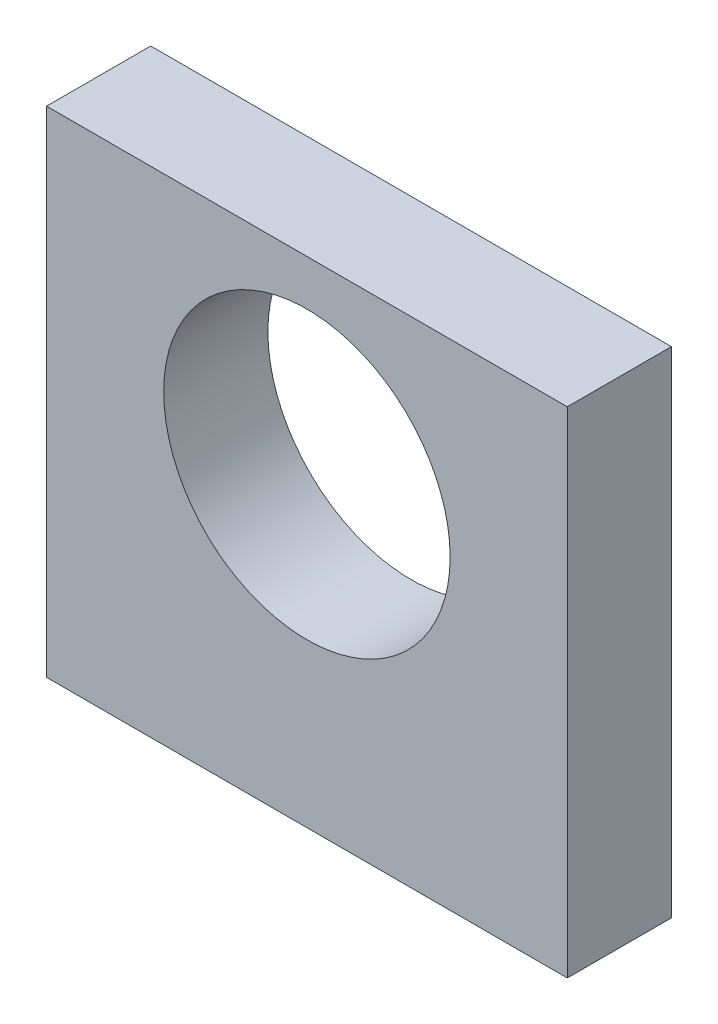
ISO-10303-21;
HEADER;
FILE_DESCRIPTION(('STEP AP214'),'2;1');
FILE_NAME('part.step','',(''),(''),'','','');
FILE_SCHEMA(('AUTOMOTIVE_DESIGN { 1 0 10303 214 1 1 1 1 }'));
ENDSEC;
DATA;
#1=APPLICATION_CONTEXT('core data for automotive mechanical design processes');
#2=APPLICATION_PROTOCOL_DEFINITION('international standard','automotive_design',2000,#1);
#3=PRODUCT_CONTEXT('',#1,'mechanical');
#4=PRODUCT('Part','Part','',(#3));
#5=PRODUCT_RELATED_PRODUCT_CATEGORY('part','',(#4));
#6=PRODUCT_DEFINITION_FORMATION('','',#4);
#7=PRODUCT_DEFINITION_CONTEXT('part definition',#1,'design');
#8=PRODUCT_DEFINITION('design','',#6,#7);
#9=PRODUCT_DEFINITION_SHAPE('','',#8);
#10=(LENGTH_UNIT() NAMED_UNIT(*) SI_UNIT(.MILLI.,.METRE.));
#11=(NAMED_UNIT(*) PLANE_ANGLE_UNIT() SI_UNIT($,.RADIAN.));
#12=(NAMED_UNIT(*) SI_UNIT($,.STERADIAN.) SOLID_ANGLE_UNIT());
#13=UNCERTAINTY_MEASURE_WITH_UNIT(LENGTH_MEASURE(1.E-05),#10,'distance_accuracy_value','');
#14=(GEOMETRIC_REPRESENTATION_CONTEXT(3) GLOBAL_UNCERTAINTY_ASSIGNED_CONTEXT((#13)) GLOBAL_UNIT_ASSIGNED_CONTEXT((#10,
#11,#12)) REPRESENTATION_CONTEXT('',''));
#15=CARTESIAN_POINT('',(0.,0.,0.));
#16=DIRECTION('',(0.,0.,1.));
#17=DIRECTION('',(1.,0.,0.));
#18=AXIS2_PLACEMENT_3D('',#15,#16,#17);
#19=CARTESIAN_POINT('',(-20.,-19.,8.));
#20=DIRECTION('',(1.,0.,0.));
#21=DIRECTION('',(0.,0.,-1.));
#22=AXIS2_PLACEMENT_3D('',#19,#20,#21);
#23=PLANE('',#22);
#24=DIRECTION('',(0.,-1.,0.));
#25=VECTOR('',#24,1.);
#26=CARTESIAN_POINT('',(-20.,-19.,0.));
#27=LINE('',#26,#25);
#28=CARTESIAN_POINT('',(-20.,19.,0.));
#29=VERTEX_POINT('',#28);
#30=CARTESIAN_POINT('',(-20.,-19.,0.));
#31=VERTEX_POINT('',#30);
#32=EDGE_CURVE('E126',#29,#31,#27,.T.);
#33=ORIENTED_EDGE('',*,*,#32,.T.);
#34=DIRECTION('',(0.,0.,-1.));
#35=VECTOR('',#34,1.);
#36=CARTESIAN_POINT('',(-20.,-19.,8.));
#37=LINE('',#36,#35);
#38=CARTESIAN_POINT('',(-20.,-19.,8.));
#39=VERTEX_POINT('',#38);
#40=EDGE_CURVE('E11',#39,#31,#37,.T.);
#41=ORIENTED_EDGE('',*,*,#40,.F.);
#42=DIRECTION('',(0.,-1.,0.));
#43=VECTOR('',#42,1.);
#44=CARTESIAN_POINT('',(-20.,-19.,8.));
#45=LINE('',#44,#43);
#46=CARTESIAN_POINT('',(-20.,19.,8.));
#47=VERTEX_POINT('',#46);
#48=EDGE_CURVE('E129',#47,#39,#45,.T.);
#49=ORIENTED_EDGE('',*,*,#48,.F.);
#50=DIRECTION('',(0.,0.,-1.));
#51=VECTOR('',#50,1.);
#52=CARTESIAN_POINT('',(-20.,19.,8.));
#53=LINE('',#52,#51);
#54=EDGE_CURVE('E135',#47,#29,#53,.T.);
#55=ORIENTED_EDGE('',*,*,#54,.T.);
#56=EDGE_LOOP('',(#33,#41,#49,#55));
#57=FACE_BOUND('',#56,.T.);
#58=ADVANCED_FACE('F42',(#57),#23,.F.);
#59=CARTESIAN_POINT('',(20.,-19.,8.));
#60=DIRECTION('',(0.,1.,0.));
#61=DIRECTION('',(-1.,0.,0.));
#62=AXIS2_PLACEMENT_3D('',#59,#60,#61);
#63=PLANE('',#62);
#64=CARTESIAN_POINT('',(12.,-19.,4.));
#65=DIRECTION('',(0.,-1.,0.));
#66=DIRECTION('',(0.,0.,-1.));
#67=AXIS2_PLACEMENT_3D('',#64,#65,#66);
#68=CIRCLE('',#67,1.883);
#69=CARTESIAN_POINT('',(12.,-19.,2.117));
#70=VERTEX_POINT('',#69);
#71=EDGE_CURVE('E113',#70,#70,#68,.T.);
#72=ORIENTED_EDGE('',*,*,#71,.F.);
#73=EDGE_LOOP('',(#72));
#74=FACE_BOUND('',#73,.T.);
#75=CARTESIAN_POINT('',(-12.,-19.,4.));
#76=DIRECTION('',(0.,-1.,0.));
#77=DIRECTION('',(0.,0.,-1.));
#78=AXIS2_PLACEMENT_3D('',#75,#76,#77);
#79=CIRCLE('',#78,1.883);
#80=CARTESIAN_POINT('',(-12.,-19.,2.117));
#81=VERTEX_POINT('',#80);
#82=EDGE_CURVE('E106',#81,#81,#79,.T.);
#83=ORIENTED_EDGE('',*,*,#82,.F.);
#84=EDGE_LOOP('',(#83));
#85=FACE_BOUND('',#84,.T.);
#86=DIRECTION('',(1.,0.,0.));
#87=VECTOR('',#86,1.);
#88=CARTESIAN_POINT('',(20.,-19.,0.));
#89=LINE('',#88,#87);
#90=CARTESIAN_POINT('',(20.,-19.,0.));
#91=VERTEX_POINT('',#90);
#92=EDGE_CURVE('E138',#31,#91,#89,.T.);
#93=ORIENTED_EDGE('',*,*,#92,.T.);
#94=DIRECTION('',(0.,0.,-1.));
#95=VECTOR('',#94,1.);
#96=CARTESIAN_POINT('',(20.,-19.,8.));
#97=LINE('',#96,#95);
#98=CARTESIAN_POINT('',(20.,-19.,8.));
#99=VERTEX_POINT('',#98);
#100=EDGE_CURVE('E50',#99,#91,#97,.T.);
#101=ORIENTED_EDGE('',*,*,#100,.F.);
#102=DIRECTION('',(1.,0.,0.));
#103=VECTOR('',#102,1.);
#104=CARTESIAN_POINT('',(20.,-19.,8.));
#105=LINE('',#104,#103);
#106=EDGE_CURVE('E89',#39,#99,#105,.T.);
#107=ORIENTED_EDGE('',*,*,#106,.F.);
#108=ORIENTED_EDGE('',*,*,#40,.T.);
#109=EDGE_LOOP('',(#93,#101,#107,#108));
#110=FACE_BOUND('',#109,.T.);
#111=ADVANCED_FACE('F162',(#74,#85,#110),#63,.F.);
#112=CARTESIAN_POINT('',(20.,-19.,8.));
#113=DIRECTION('',(-1.,0.,0.));
#114=DIRECTION('',(0.,0.,1.));
#115=AXIS2_PLACEMENT_3D('',#112,#113,#114);
#116=PLANE('',#115);
#117=DIRECTION('',(0.,1.,0.));
#118=VECTOR('',#117,1.);
#119=CARTESIAN_POINT('',(20.,-19.,0.));
#120=LINE('',#119,#118);
#121=CARTESIAN_POINT('',(20.,19.,0.));
#122=VERTEX_POINT('',#121);
#123=EDGE_CURVE('E76',#91,#122,#120,.T.);
#124=ORIENTED_EDGE('',*,*,#123,.T.);
#125=DIRECTION('',(0.,0.,-1.));
#126=VECTOR('',#125,1.);
#127=CARTESIAN_POINT('',(20.,19.,8.));
#128=LINE('',#127,#126);
#129=CARTESIAN_POINT('',(20.,19.,8.));
#130=VERTEX_POINT('',#129);
#131=EDGE_CURVE('E143',#130,#122,#128,.T.);
#132=ORIENTED_EDGE('',*,*,#131,.F.);
#133=DIRECTION('',(0.,1.,0.));
#134=VECTOR('',#133,1.);
#135=CARTESIAN_POINT('',(20.,-19.,8.));
#136=LINE('',#135,#134);
#137=EDGE_CURVE('E132',#99,#130,#136,.T.);
#138=ORIENTED_EDGE('',*,*,#137,.F.);
#139=ORIENTED_EDGE('',*,*,#100,.T.);
#140=EDGE_LOOP('',(#124,#132,#138,#139));
#141=FACE_BOUND('',#140,.T.);
#142=ADVANCED_FACE('F145',(#141),#116,.F.);
#143=CARTESIAN_POINT('',(20.,19.,8.));
#144=DIRECTION('',(0.,-1.,0.));
#145=DIRECTION('',(1.,0.,0.));
#146=AXIS2_PLACEMENT_3D('',#143,#144,#145);
#147=PLANE('',#146);
#148=DIRECTION('',(-1.,0.,0.));
#149=VECTOR('',#148,1.);
#150=CARTESIAN_POINT('',(20.,19.,0.));
#151=LINE('',#150,#149);
#152=EDGE_CURVE('E82',#122,#29,#151,.T.);
#153=ORIENTED_EDGE('',*,*,#152,.T.);
#154=ORIENTED_EDGE('',*,*,#54,.F.);
#155=DIRECTION('',(-1.,0.,0.));
#156=VECTOR('',#155,1.);
#157=CARTESIAN_POINT('',(20.,19.,8.));
#158=LINE('',#157,#156);
#159=EDGE_CURVE('E58',#130,#47,#158,.T.);
#160=ORIENTED_EDGE('',*,*,#159,.F.);
#161=ORIENTED_EDGE('',*,*,#131,.T.);
#162=EDGE_LOOP('',(#153,#154,#160,#161));
#163=FACE_BOUND('',#162,.T.);
#164=ADVANCED_FACE('F152',(#163),#147,.F.);
#165=CARTESIAN_POINT('',(0.,0.,8.));
#166=DIRECTION('',(0.,0.,1.));
#167=DIRECTION('',(1.,0.,0.));
#168=AXIS2_PLACEMENT_3D('',#165,#166,#167);
#169=PLANE('',#168);
#170=CARTESIAN_POINT('',(0.,4.5,8.));
#171=DIRECTION('',(0.,0.,1.));
#172=DIRECTION('',(1.,0.,0.));
#173=AXIS2_PLACEMENT_3D('',#170,#171,#172);
#174=CIRCLE('',#173,11.);
#175=CARTESIAN_POINT('',(11.,4.5,8.));
#176=VERTEX_POINT('',#175);
#177=EDGE_CURVE('E122',#176,#176,#174,.T.);
#178=ORIENTED_EDGE('',*,*,#177,.F.);
#179=EDGE_LOOP('',(#178));
#180=FACE_BOUND('',#179,.T.);
#181=ORIENTED_EDGE('',*,*,#48,.T.);
#182=ORIENTED_EDGE('',*,*,#106,.T.);
#183=ORIENTED_EDGE('',*,*,#137,.T.);
#184=ORIENTED_EDGE('',*,*,#159,.T.);
#185=EDGE_LOOP('',(#181,#182,#183,#184));
#186=FACE_BOUND('',#185,.T.);
#187=ADVANCED_FACE('F154',(#180,#186),#169,.T.);
#188=CARTESIAN_POINT('',(0.,0.,0.));
#189=DIRECTION('',(0.,0.,1.));
#190=DIRECTION('',(1.,0.,0.));
#191=AXIS2_PLACEMENT_3D('',#188,#189,#190);
#192=PLANE('',#191);
#193=CARTESIAN_POINT('',(0.,4.5,0.));
#194=DIRECTION('',(0.,0.,1.));
#195=DIRECTION('',(1.,0.,0.));
#196=AXIS2_PLACEMENT_3D('',#193,#194,#195);
#197=CIRCLE('',#196,11.);
#198=CARTESIAN_POINT('',(11.,4.5,0.));
#199=VERTEX_POINT('',#198);
#200=EDGE_CURVE('E123',#199,#199,#197,.T.);
#201=ORIENTED_EDGE('',*,*,#200,.T.);
#202=EDGE_LOOP('',(#201));
#203=FACE_BOUND('',#202,.T.);
#204=ORIENTED_EDGE('',*,*,#32,.F.);
#205=ORIENTED_EDGE('',*,*,#152,.F.);
#206=ORIENTED_EDGE('',*,*,#123,.F.);
#207=ORIENTED_EDGE('',*,*,#92,.F.);
#208=EDGE_LOOP('',(#204,#205,#206,#207));
#209=FACE_BOUND('',#208,.T.);
#210=ADVANCED_FACE('F148',(#203,#209),#192,.F.);
#211=CARTESIAN_POINT('',(0.,4.5,0.));
#212=DIRECTION('',(0.,0.,1.));
#213=DIRECTION('',(1.,0.,0.));
#214=AXIS2_PLACEMENT_3D('',#211,#212,#213);
#215=CYLINDRICAL_SURFACE('',#214,11.);
#216=ORIENTED_EDGE('',*,*,#200,.F.);
#217=EDGE_LOOP('',(#216));
#218=FACE_BOUND('',#217,.T.);
#219=ORIENTED_EDGE('',*,*,#177,.T.);
#220=EDGE_LOOP('',(#219));
#221=FACE_BOUND('',#220,.T.);
#222=ADVANCED_FACE('F192',(#218,#221),#215,.F.);
#223=CARTESIAN_POINT('',(-12.,-9.,4.));
#224=DIRECTION('',(0.,-1.,0.));
#225=DIRECTION('',(0.,0.,-1.));
#226=AXIS2_PLACEMENT_3D('',#223,#224,#225);
#227=CONICAL_SURFACE('',#226,1.575,1.02974425867665);
#228=CARTESIAN_POINT('',(-12.,-8.05364452503159,4.));
#229=VERTEX_POINT('',#228);
#230=VERTEX_LOOP('',#229);
#231=FACE_BOUND('',#230,.T.);
#232=CARTESIAN_POINT('',(-12.,-9.,4.));
#233=DIRECTION('',(0.,-1.,0.));
#234=DIRECTION('',(0.,0.,-1.));
#235=AXIS2_PLACEMENT_3D('',#232,#233,#234);
#236=CIRCLE('',#235,1.575);
#237=CARTESIAN_POINT('',(-12.,-9.,2.425));
#238=VERTEX_POINT('',#237);
#239=EDGE_CURVE('E119',#238,#238,#236,.T.);
#240=ORIENTED_EDGE('',*,*,#239,.T.);
#241=EDGE_LOOP('',(#240));
#242=FACE_BOUND('',#241,.T.);
#243=ADVANCED_FACE('F184',(#231,#242),#227,.F.);
#244=CARTESIAN_POINT('',(-12.,-19.,4.));
#245=DIRECTION('',(0.,-1.,0.));
#246=DIRECTION('',(0.,0.,-1.));
#247=AXIS2_PLACEMENT_3D('',#244,#245,#246);
#248=CYLINDRICAL_SURFACE('',#247,1.575);
#249=ORIENTED_EDGE('',*,*,#239,.F.);
#250=EDGE_LOOP('',(#249));
#251=FACE_BOUND('',#250,.T.);
#252=CARTESIAN_POINT('',(-12.,-18.692,4.));
#253=DIRECTION('',(0.,-1.,0.));
#254=DIRECTION('',(0.,0.,-1.));
#255=AXIS2_PLACEMENT_3D('',#252,#253,#254);
#256=CIRCLE('',#255,1.575);
#257=CARTESIAN_POINT('',(-12.,-18.692,2.425));
#258=VERTEX_POINT('',#257);
#259=EDGE_CURVE('E110',#258,#258,#256,.T.);
#260=ORIENTED_EDGE('',*,*,#259,.T.);
#261=EDGE_LOOP('',(#260));
#262=FACE_BOUND('',#261,.T.);
#263=ADVANCED_FACE('F178',(#251,#262),#248,.F.);
#264=CARTESIAN_POINT('',(-12.,-19.,4.));
#265=DIRECTION('',(0.,-1.,0.));
#266=DIRECTION('',(0.,0.,-1.));
#267=AXIS2_PLACEMENT_3D('',#264,#265,#266);
#268=CONICAL_SURFACE('',#267,1.883,0.785398163397448);
#269=ORIENTED_EDGE('',*,*,#259,.F.);
#270=EDGE_LOOP('',(#269));
#271=FACE_BOUND('',#270,.T.);
#272=ORIENTED_EDGE('',*,*,#82,.T.);
#273=EDGE_LOOP('',(#272));
#274=FACE_BOUND('',#273,.T.);
#275=ADVANCED_FACE('F100',(#271,#274),#268,.F.);
#276=CARTESIAN_POINT('',(12.,-9.,4.));
#277=DIRECTION('',(0.,-1.,0.));
#278=DIRECTION('',(0.,0.,-1.));
#279=AXIS2_PLACEMENT_3D('',#276,#277,#278);
#280=CONICAL_SURFACE('',#279,1.575,1.02974425867665);
#281=CARTESIAN_POINT('',(12.,-8.05364452503159,4.));
#282=VERTEX_POINT('',#281);
#283=VERTEX_LOOP('',#282);
#284=FACE_BOUND('',#283,.T.);
#285=CARTESIAN_POINT('',(12.,-9.,4.));
#286=DIRECTION('',(0.,-1.,0.));
#287=DIRECTION('',(0.,0.,-1.));
#288=AXIS2_PLACEMENT_3D('',#285,#286,#287);
#289=CIRCLE('',#288,1.575);
#290=CARTESIAN_POINT('',(12.,-9.,2.425));
#291=VERTEX_POINT('',#290);
#292=EDGE_CURVE('E104',#291,#291,#289,.T.);
#293=ORIENTED_EDGE('',*,*,#292,.T.);
#294=EDGE_LOOP('',(#293));
#295=FACE_BOUND('',#294,.T.);
#296=ADVANCED_FACE('F96',(#284,#295),#280,.F.);
#297=CARTESIAN_POINT('',(12.,-19.,4.));
#298=DIRECTION('',(0.,-1.,0.));
#299=DIRECTION('',(0.,0.,-1.));
#300=AXIS2_PLACEMENT_3D('',#297,#298,#299);
#301=CYLINDRICAL_SURFACE('',#300,1.575);
#302=ORIENTED_EDGE('',*,*,#292,.F.);
#303=EDGE_LOOP('',(#302));
#304=FACE_BOUND('',#303,.T.);
#305=CARTESIAN_POINT('',(12.,-18.692,4.));
#306=DIRECTION('',(0.,-1.,0.));
#307=DIRECTION('',(0.,0.,-1.));
#308=AXIS2_PLACEMENT_3D('',#305,#306,#307);
#309=CIRCLE('',#308,1.575);
#310=CARTESIAN_POINT('',(12.,-18.692,2.425));
#311=VERTEX_POINT('',#310);
#312=EDGE_CURVE('E107',#311,#311,#309,.T.);
#313=ORIENTED_EDGE('',*,*,#312,.T.);
#314=EDGE_LOOP('',(#313));
#315=FACE_BOUND('',#314,.T.);
#316=ADVANCED_FACE('F99',(#304,#315),#301,.F.);
#317=CARTESIAN_POINT('',(12.,-19.,4.));
#318=DIRECTION('',(0.,-1.,0.));
#319=DIRECTION('',(0.,0.,-1.));
#320=AXIS2_PLACEMENT_3D('',#317,#318,#319);
#321=CONICAL_SURFACE('',#320,1.883,0.785398163397448);
#322=ORIENTED_EDGE('',*,*,#312,.F.);
#323=EDGE_LOOP('',(#322));
#324=FACE_BOUND('',#323,.T.);
#325=ORIENTED_EDGE('',*,*,#71,.T.);
#326=EDGE_LOOP('',(#325));
#327=FACE_BOUND('',#326,.T.);
#328=ADVANCED_FACE('F227',(#324,#327),#321,.F.);
#329=CLOSED_SHELL('',(#58,#111,#142,#164,#187,#210,#222,#243,#263,#275,#296,#316,#328));
#330=MANIFOLD_SOLID_BREP('B2',#329);
#331=ADVANCED_BREP_SHAPE_REPRESENTATION('',(#18,#330),#14);
#332=SHAPE_DEFINITION_REPRESENTATION(#9,#331);
ENDSEC;
END-ISO-10303-21;
